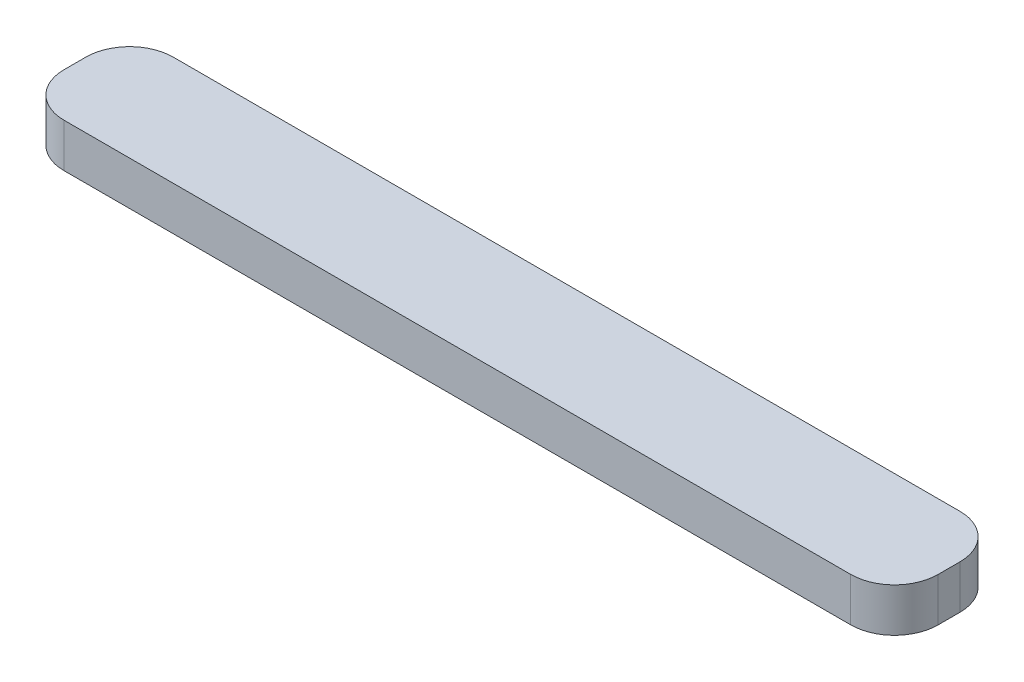
ISO-10303-21;
HEADER;
FILE_DESCRIPTION(('STEP AP214'),'2;1');
FILE_NAME('part.step','',(''),(''),'','','');
FILE_SCHEMA(('AUTOMOTIVE_DESIGN { 1 0 10303 214 1 1 1 1 }'));
ENDSEC;
DATA;
#1=APPLICATION_CONTEXT('core data for automotive mechanical design processes');
#2=APPLICATION_PROTOCOL_DEFINITION('international standard','automotive_design',2000,#1);
#3=PRODUCT_CONTEXT('',#1,'mechanical');
#4=PRODUCT('Part','Part','',(#3));
#5=PRODUCT_RELATED_PRODUCT_CATEGORY('part','',(#4));
#6=PRODUCT_DEFINITION_FORMATION('','',#4);
#7=PRODUCT_DEFINITION_CONTEXT('part definition',#1,'design');
#8=PRODUCT_DEFINITION('design','',#6,#7);
#9=PRODUCT_DEFINITION_SHAPE('','',#8);
#10=(LENGTH_UNIT() NAMED_UNIT(*) SI_UNIT(.MILLI.,.METRE.));
#11=(NAMED_UNIT(*) PLANE_ANGLE_UNIT() SI_UNIT($,.RADIAN.));
#12=(NAMED_UNIT(*) SI_UNIT($,.STERADIAN.) SOLID_ANGLE_UNIT());
#13=UNCERTAINTY_MEASURE_WITH_UNIT(LENGTH_MEASURE(1.E-05),#10,'distance_accuracy_value','');
#14=(GEOMETRIC_REPRESENTATION_CONTEXT(3) GLOBAL_UNCERTAINTY_ASSIGNED_CONTEXT((#13)) GLOBAL_UNIT_ASSIGNED_CONTEXT((#10,
#11,#12)) REPRESENTATION_CONTEXT('',''));
#15=CARTESIAN_POINT('',(0.,0.,0.));
#16=DIRECTION('',(0.,0.,1.));
#17=DIRECTION('',(1.,0.,0.));
#18=AXIS2_PLACEMENT_3D('',#15,#16,#17);
#19=CARTESIAN_POINT('',(18.,2.,0.5));
#20=DIRECTION('',(0.,-1.,0.));
#21=DIRECTION('',(0.,0.,-1.));
#22=AXIS2_PLACEMENT_3D('',#19,#20,#21);
#23=CYLINDRICAL_SURFACE('',#22,2.);
#24=CARTESIAN_POINT('',(18.,0.,0.5));
#25=DIRECTION('',(0.,1.,0.));
#26=DIRECTION('',(0.,0.,1.));
#27=AXIS2_PLACEMENT_3D('',#24,#25,#26);
#28=CIRCLE('',#27,2.);
#29=CARTESIAN_POINT('',(18.,0.,2.5));
#30=VERTEX_POINT('',#29);
#31=CARTESIAN_POINT('',(20.,0.,0.499999999999985));
#32=VERTEX_POINT('',#31);
#33=EDGE_CURVE('E129',#30,#32,#28,.T.);
#34=ORIENTED_EDGE('',*,*,#33,.T.);
#35=DIRECTION('',(0.,-1.,0.));
#36=VECTOR('',#35,1.);
#37=CARTESIAN_POINT('',(20.,2.,0.499999999999985));
#38=LINE('',#37,#36);
#39=CARTESIAN_POINT('',(20.,2.,0.499999999999985));
#40=VERTEX_POINT('',#39);
#41=EDGE_CURVE('E11',#40,#32,#38,.T.);
#42=ORIENTED_EDGE('',*,*,#41,.F.);
#43=CARTESIAN_POINT('',(18.,2.,0.5));
#44=DIRECTION('',(0.,1.,0.));
#45=DIRECTION('',(0.,0.,1.));
#46=AXIS2_PLACEMENT_3D('',#43,#44,#45);
#47=CIRCLE('',#46,2.);
#48=CARTESIAN_POINT('',(18.,2.,2.5));
#49=VERTEX_POINT('',#48);
#50=EDGE_CURVE('E143',#49,#40,#47,.T.);
#51=ORIENTED_EDGE('',*,*,#50,.F.);
#52=DIRECTION('',(0.,-1.,0.));
#53=VECTOR('',#52,1.);
#54=CARTESIAN_POINT('',(18.,2.,2.5));
#55=LINE('',#54,#53);
#56=EDGE_CURVE('E125',#49,#30,#55,.T.);
#57=ORIENTED_EDGE('',*,*,#56,.T.);
#58=EDGE_LOOP('',(#34,#42,#51,#57));
#59=FACE_BOUND('',#58,.T.);
#60=ADVANCED_FACE('F33',(#59),#23,.T.);
#61=CARTESIAN_POINT('',(20.,2.,-0.499999999999986));
#62=DIRECTION('',(-1.,0.,0.));
#63=DIRECTION('',(0.,0.,1.));
#64=AXIS2_PLACEMENT_3D('',#61,#62,#63);
#65=PLANE('',#64);
#66=DIRECTION('',(0.,0.,-1.));
#67=VECTOR('',#66,1.);
#68=CARTESIAN_POINT('',(20.,0.,-0.499999999999986));
#69=LINE('',#68,#67);
#70=CARTESIAN_POINT('',(20.,0.,-0.499999999999986));
#71=VERTEX_POINT('',#70);
#72=EDGE_CURVE('E132',#32,#71,#69,.T.);
#73=ORIENTED_EDGE('',*,*,#72,.T.);
#74=DIRECTION('',(0.,-1.,0.));
#75=VECTOR('',#74,1.);
#76=CARTESIAN_POINT('',(20.,2.,-0.499999999999986));
#77=LINE('',#76,#75);
#78=CARTESIAN_POINT('',(20.,2.,-0.499999999999986));
#79=VERTEX_POINT('',#78);
#80=EDGE_CURVE('E41',#79,#71,#77,.T.);
#81=ORIENTED_EDGE('',*,*,#80,.F.);
#82=DIRECTION('',(0.,0.,-1.));
#83=VECTOR('',#82,1.);
#84=CARTESIAN_POINT('',(20.,2.,-0.499999999999986));
#85=LINE('',#84,#83);
#86=EDGE_CURVE('E92',#40,#79,#85,.T.);
#87=ORIENTED_EDGE('',*,*,#86,.F.);
#88=ORIENTED_EDGE('',*,*,#41,.T.);
#89=EDGE_LOOP('',(#73,#81,#87,#88));
#90=FACE_BOUND('',#89,.T.);
#91=ADVANCED_FACE('F178',(#90),#65,.F.);
#92=CARTESIAN_POINT('',(18.,2.,-0.5));
#93=DIRECTION('',(0.,-1.,0.));
#94=DIRECTION('',(0.,0.,-1.));
#95=AXIS2_PLACEMENT_3D('',#92,#93,#94);
#96=CYLINDRICAL_SURFACE('',#95,2.);
#97=CARTESIAN_POINT('',(18.,0.,-0.5));
#98=DIRECTION('',(0.,1.,0.));
#99=DIRECTION('',(0.,0.,-1.));
#100=AXIS2_PLACEMENT_3D('',#97,#98,#99);
#101=CIRCLE('',#100,2.);
#102=CARTESIAN_POINT('',(18.,0.,-2.5));
#103=VERTEX_POINT('',#102);
#104=EDGE_CURVE('E134',#71,#103,#101,.T.);
#105=ORIENTED_EDGE('',*,*,#104,.T.);
#106=DIRECTION('',(0.,-1.,0.));
#107=VECTOR('',#106,1.);
#108=CARTESIAN_POINT('',(18.,2.,-2.5));
#109=LINE('',#108,#107);
#110=CARTESIAN_POINT('',(18.,2.,-2.5));
#111=VERTEX_POINT('',#110);
#112=EDGE_CURVE('E150',#111,#103,#109,.T.);
#113=ORIENTED_EDGE('',*,*,#112,.F.);
#114=CARTESIAN_POINT('',(18.,2.,-0.5));
#115=DIRECTION('',(0.,1.,0.));
#116=DIRECTION('',(0.,0.,-1.));
#117=AXIS2_PLACEMENT_3D('',#114,#115,#116);
#118=CIRCLE('',#117,2.);
#119=EDGE_CURVE('E158',#79,#111,#118,.T.);
#120=ORIENTED_EDGE('',*,*,#119,.F.);
#121=ORIENTED_EDGE('',*,*,#80,.T.);
#122=EDGE_LOOP('',(#105,#113,#120,#121));
#123=FACE_BOUND('',#122,.T.);
#124=ADVANCED_FACE('F156',(#123),#96,.T.);
#125=CARTESIAN_POINT('',(-18.,2.,-2.5));
#126=DIRECTION('',(0.,0.,1.));
#127=DIRECTION('',(1.,0.,0.));
#128=AXIS2_PLACEMENT_3D('',#125,#126,#127);
#129=PLANE('',#128);
#130=DIRECTION('',(-1.,0.,0.));
#131=VECTOR('',#130,1.);
#132=CARTESIAN_POINT('',(-18.,0.,-2.5));
#133=LINE('',#132,#131);
#134=CARTESIAN_POINT('',(-18.,0.,-2.5));
#135=VERTEX_POINT('',#134);
#136=EDGE_CURVE('E136',#103,#135,#133,.T.);
#137=ORIENTED_EDGE('',*,*,#136,.T.);
#138=DIRECTION('',(0.,-1.,0.));
#139=VECTOR('',#138,1.);
#140=CARTESIAN_POINT('',(-18.,2.,-2.5));
#141=LINE('',#140,#139);
#142=CARTESIAN_POINT('',(-18.,2.,-2.5));
#143=VERTEX_POINT('',#142);
#144=EDGE_CURVE('E147',#143,#135,#141,.T.);
#145=ORIENTED_EDGE('',*,*,#144,.F.);
#146=DIRECTION('',(-1.,0.,0.));
#147=VECTOR('',#146,1.);
#148=CARTESIAN_POINT('',(-18.,2.,-2.5));
#149=LINE('',#148,#147);
#150=EDGE_CURVE('E170',#111,#143,#149,.T.);
#151=ORIENTED_EDGE('',*,*,#150,.F.);
#152=ORIENTED_EDGE('',*,*,#112,.T.);
#153=EDGE_LOOP('',(#137,#145,#151,#152));
#154=FACE_BOUND('',#153,.T.);
#155=ADVANCED_FACE('F166',(#154),#129,.F.);
#156=CARTESIAN_POINT('',(-18.,2.,-0.5));
#157=DIRECTION('',(0.,-1.,0.));
#158=DIRECTION('',(0.,0.,-1.));
#159=AXIS2_PLACEMENT_3D('',#156,#157,#158);
#160=CYLINDRICAL_SURFACE('',#159,2.);
#161=CARTESIAN_POINT('',(-18.,0.,-0.5));
#162=DIRECTION('',(0.,1.,0.));
#163=DIRECTION('',(0.,0.,1.));
#164=AXIS2_PLACEMENT_3D('',#161,#162,#163);
#165=CIRCLE('',#164,2.);
#166=CARTESIAN_POINT('',(-20.,0.,-0.499999999999986));
#167=VERTEX_POINT('',#166);
#168=EDGE_CURVE('E138',#135,#167,#165,.T.);
#169=ORIENTED_EDGE('',*,*,#168,.T.);
#170=DIRECTION('',(0.,-1.,0.));
#171=VECTOR('',#170,1.);
#172=CARTESIAN_POINT('',(-20.,2.,-0.499999999999986));
#173=LINE('',#172,#171);
#174=CARTESIAN_POINT('',(-20.,2.,-0.499999999999986));
#175=VERTEX_POINT('',#174);
#176=EDGE_CURVE('E120',#175,#167,#173,.T.);
#177=ORIENTED_EDGE('',*,*,#176,.F.);
#178=CARTESIAN_POINT('',(-18.,2.,-0.5));
#179=DIRECTION('',(0.,1.,0.));
#180=DIRECTION('',(0.,0.,1.));
#181=AXIS2_PLACEMENT_3D('',#178,#179,#180);
#182=CIRCLE('',#181,2.);
#183=EDGE_CURVE('E111',#143,#175,#182,.T.);
#184=ORIENTED_EDGE('',*,*,#183,.F.);
#185=ORIENTED_EDGE('',*,*,#144,.T.);
#186=EDGE_LOOP('',(#169,#177,#184,#185));
#187=FACE_BOUND('',#186,.T.);
#188=ADVANCED_FACE('F169',(#187),#160,.T.);
#189=CARTESIAN_POINT('',(-20.,2.,-0.499999999999986));
#190=DIRECTION('',(1.,0.,0.));
#191=DIRECTION('',(0.,0.,-1.));
#192=AXIS2_PLACEMENT_3D('',#189,#190,#191);
#193=PLANE('',#192);
#194=DIRECTION('',(0.,0.,1.));
#195=VECTOR('',#194,1.);
#196=CARTESIAN_POINT('',(-20.,0.,-0.499999999999986));
#197=LINE('',#196,#195);
#198=CARTESIAN_POINT('',(-20.,0.,0.499999999999985));
#199=VERTEX_POINT('',#198);
#200=EDGE_CURVE('E119',#167,#199,#197,.T.);
#201=ORIENTED_EDGE('',*,*,#200,.T.);
#202=DIRECTION('',(0.,-1.,0.));
#203=VECTOR('',#202,1.);
#204=CARTESIAN_POINT('',(-20.,2.,0.499999999999985));
#205=LINE('',#204,#203);
#206=CARTESIAN_POINT('',(-20.,2.,0.499999999999985));
#207=VERTEX_POINT('',#206);
#208=EDGE_CURVE('E116',#207,#199,#205,.T.);
#209=ORIENTED_EDGE('',*,*,#208,.F.);
#210=DIRECTION('',(0.,0.,1.));
#211=VECTOR('',#210,1.);
#212=CARTESIAN_POINT('',(-20.,2.,-0.499999999999986));
#213=LINE('',#212,#211);
#214=EDGE_CURVE('E105',#175,#207,#213,.T.);
#215=ORIENTED_EDGE('',*,*,#214,.F.);
#216=ORIENTED_EDGE('',*,*,#176,.T.);
#217=EDGE_LOOP('',(#201,#209,#215,#216));
#218=FACE_BOUND('',#217,.T.);
#219=ADVANCED_FACE('F117',(#218),#193,.F.);
#220=CARTESIAN_POINT('',(-18.,2.,0.5));
#221=DIRECTION('',(0.,-1.,0.));
#222=DIRECTION('',(0.,0.,-1.));
#223=AXIS2_PLACEMENT_3D('',#220,#221,#222);
#224=CYLINDRICAL_SURFACE('',#223,2.);
#225=CARTESIAN_POINT('',(-18.,0.,0.5));
#226=DIRECTION('',(0.,1.,0.));
#227=DIRECTION('',(0.,0.,1.));
#228=AXIS2_PLACEMENT_3D('',#225,#226,#227);
#229=CIRCLE('',#228,2.);
#230=CARTESIAN_POINT('',(-18.,0.,2.5));
#231=VERTEX_POINT('',#230);
#232=EDGE_CURVE('E78',#199,#231,#229,.T.);
#233=ORIENTED_EDGE('',*,*,#232,.T.);
#234=DIRECTION('',(0.,-1.,0.));
#235=VECTOR('',#234,1.);
#236=CARTESIAN_POINT('',(-18.,2.,2.5));
#237=LINE('',#236,#235);
#238=CARTESIAN_POINT('',(-18.,2.,2.5));
#239=VERTEX_POINT('',#238);
#240=EDGE_CURVE('E121',#239,#231,#237,.T.);
#241=ORIENTED_EDGE('',*,*,#240,.F.);
#242=CARTESIAN_POINT('',(-18.,2.,0.5));
#243=DIRECTION('',(0.,1.,0.));
#244=DIRECTION('',(0.,0.,1.));
#245=AXIS2_PLACEMENT_3D('',#242,#243,#244);
#246=CIRCLE('',#245,2.);
#247=EDGE_CURVE('E109',#207,#239,#246,.T.);
#248=ORIENTED_EDGE('',*,*,#247,.F.);
#249=ORIENTED_EDGE('',*,*,#208,.T.);
#250=EDGE_LOOP('',(#233,#241,#248,#249));
#251=FACE_BOUND('',#250,.T.);
#252=ADVANCED_FACE('F123',(#251),#224,.T.);
#253=CARTESIAN_POINT('',(-18.,2.,2.5));
#254=DIRECTION('',(0.,0.,-1.));
#255=DIRECTION('',(-1.,0.,0.));
#256=AXIS2_PLACEMENT_3D('',#253,#254,#255);
#257=PLANE('',#256);
#258=DIRECTION('',(1.,0.,0.));
#259=VECTOR('',#258,1.);
#260=CARTESIAN_POINT('',(-18.,0.,2.5));
#261=LINE('',#260,#259);
#262=EDGE_CURVE('E84',#231,#30,#261,.T.);
#263=ORIENTED_EDGE('',*,*,#262,.T.);
#264=ORIENTED_EDGE('',*,*,#56,.F.);
#265=DIRECTION('',(1.,0.,0.));
#266=VECTOR('',#265,1.);
#267=CARTESIAN_POINT('',(-18.,2.,2.5));
#268=LINE('',#267,#266);
#269=EDGE_CURVE('E49',#239,#49,#268,.T.);
#270=ORIENTED_EDGE('',*,*,#269,.F.);
#271=ORIENTED_EDGE('',*,*,#240,.T.);
#272=EDGE_LOOP('',(#263,#264,#270,#271));
#273=FACE_BOUND('',#272,.T.);
#274=ADVANCED_FACE('F194',(#273),#257,.F.);
#275=CARTESIAN_POINT('',(18.,2.,0.5));
#276=DIRECTION('',(0.,1.,0.));
#277=DIRECTION('',(0.,0.,1.));
#278=AXIS2_PLACEMENT_3D('',#275,#276,#277);
#279=PLANE('',#278);
#280=ORIENTED_EDGE('',*,*,#50,.T.);
#281=ORIENTED_EDGE('',*,*,#86,.T.);
#282=ORIENTED_EDGE('',*,*,#119,.T.);
#283=ORIENTED_EDGE('',*,*,#150,.T.);
#284=ORIENTED_EDGE('',*,*,#183,.T.);
#285=ORIENTED_EDGE('',*,*,#214,.T.);
#286=ORIENTED_EDGE('',*,*,#247,.T.);
#287=ORIENTED_EDGE('',*,*,#269,.T.);
#288=EDGE_LOOP('',(#280,#281,#282,#283,#284,#285,#286,#287));
#289=FACE_BOUND('',#288,.T.);
#290=ADVANCED_FACE('F107',(#289),#279,.T.);
#291=CARTESIAN_POINT('',(18.,0.,0.5));
#292=DIRECTION('',(0.,1.,0.));
#293=DIRECTION('',(0.,0.,1.));
#294=AXIS2_PLACEMENT_3D('',#291,#292,#293);
#295=PLANE('',#294);
#296=ORIENTED_EDGE('',*,*,#33,.F.);
#297=ORIENTED_EDGE('',*,*,#262,.F.);
#298=ORIENTED_EDGE('',*,*,#232,.F.);
#299=ORIENTED_EDGE('',*,*,#200,.F.);
#300=ORIENTED_EDGE('',*,*,#168,.F.);
#301=ORIENTED_EDGE('',*,*,#136,.F.);
#302=ORIENTED_EDGE('',*,*,#104,.F.);
#303=ORIENTED_EDGE('',*,*,#72,.F.);
#304=EDGE_LOOP('',(#296,#297,#298,#299,#300,#301,#302,#303));
#305=FACE_BOUND('',#304,.T.);
#306=ADVANCED_FACE('F162',(#305),#295,.F.);
#307=CLOSED_SHELL('',(#60,#91,#124,#155,#188,#219,#252,#274,#290,#306));
#308=MANIFOLD_SOLID_BREP('B2',#307);
#309=ADVANCED_BREP_SHAPE_REPRESENTATION('',(#18,#308),#14);
#310=SHAPE_DEFINITION_REPRESENTATION(#9,#309);
ENDSEC;
END-ISO-10303-21;
